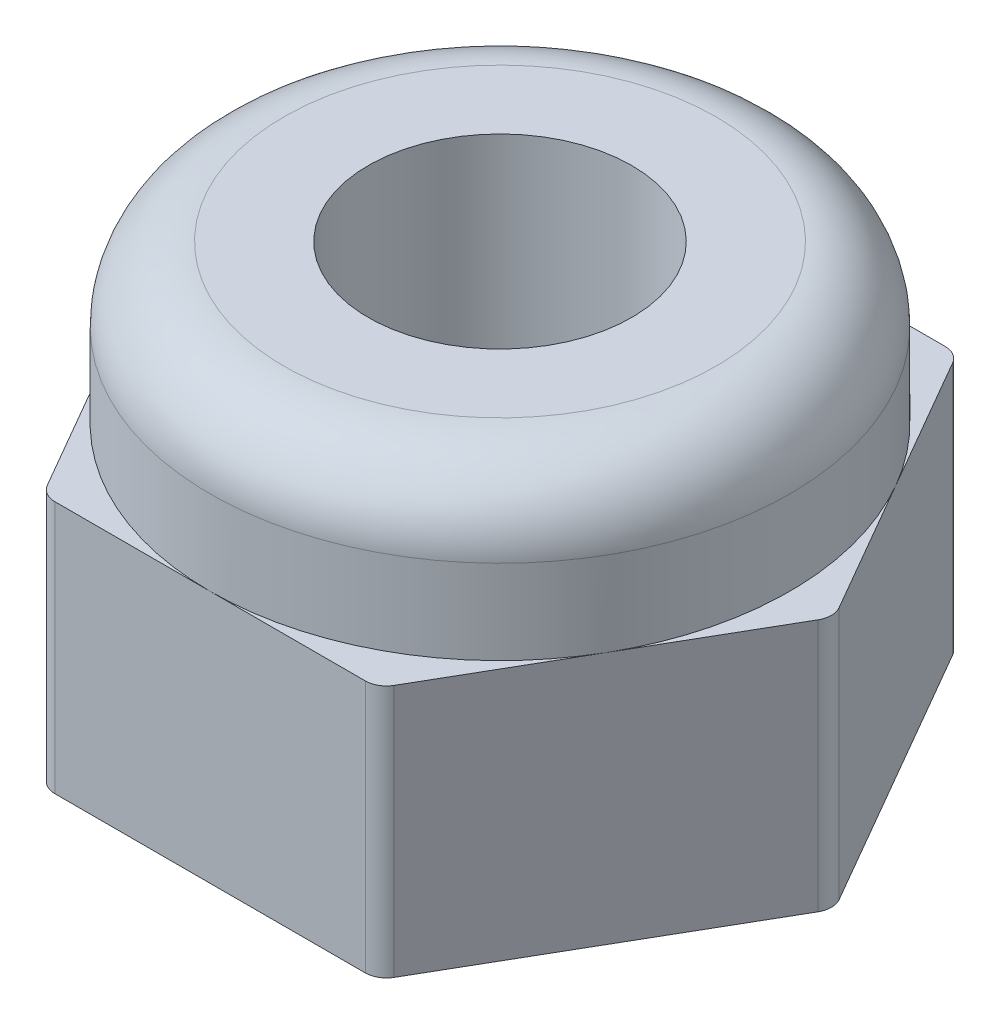
ISO-10303-21;
HEADER;
FILE_DESCRIPTION(('STEP AP214'),'2;1');
FILE_NAME('part.step','',(''),(''),'','','');
FILE_SCHEMA(('AUTOMOTIVE_DESIGN { 1 0 10303 214 1 1 1 1 }'));
ENDSEC;
DATA;
#1=APPLICATION_CONTEXT('core data for automotive mechanical design processes');
#2=APPLICATION_PROTOCOL_DEFINITION('international standard','automotive_design',2000,#1);
#3=PRODUCT_CONTEXT('',#1,'mechanical');
#4=PRODUCT('Part','Part','',(#3));
#5=PRODUCT_RELATED_PRODUCT_CATEGORY('part','',(#4));
#6=PRODUCT_DEFINITION_FORMATION('','',#4);
#7=PRODUCT_DEFINITION_CONTEXT('part definition',#1,'design');
#8=PRODUCT_DEFINITION('design','',#6,#7);
#9=PRODUCT_DEFINITION_SHAPE('','',#8);
#10=(LENGTH_UNIT() NAMED_UNIT(*) SI_UNIT(.MILLI.,.METRE.));
#11=(NAMED_UNIT(*) PLANE_ANGLE_UNIT() SI_UNIT($,.RADIAN.));
#12=(NAMED_UNIT(*) SI_UNIT($,.STERADIAN.) SOLID_ANGLE_UNIT());
#13=UNCERTAINTY_MEASURE_WITH_UNIT(LENGTH_MEASURE(1.E-05),#10,'distance_accuracy_value','');
#14=(GEOMETRIC_REPRESENTATION_CONTEXT(3) GLOBAL_UNCERTAINTY_ASSIGNED_CONTEXT((#13)) GLOBAL_UNIT_ASSIGNED_CONTEXT((#10,
#11,#12)) REPRESENTATION_CONTEXT('',''));
#15=CARTESIAN_POINT('',(0.,0.,0.));
#16=DIRECTION('',(0.,0.,1.));
#17=DIRECTION('',(1.,0.,0.));
#18=AXIS2_PLACEMENT_3D('',#15,#16,#17);
#19=CARTESIAN_POINT('',(0.,2.4,0.));
#20=DIRECTION('',(0.,1.,0.));
#21=DIRECTION('',(0.,0.,1.));
#22=AXIS2_PLACEMENT_3D('',#19,#20,#21);
#23=PLANE('',#22);
#24=DIRECTION('',(1.,0.,0.));
#25=VECTOR('',#24,1.);
#26=CARTESIAN_POINT('',(-1.58771324027147,2.4,2.75));
#27=LINE('',#26,#25);
#28=CARTESIAN_POINT('',(0.,2.4,2.75));
#29=VERTEX_POINT('',#28);
#30=CARTESIAN_POINT('',(1.47224318643355,2.4,2.75));
#31=VERTEX_POINT('',#30);
#32=EDGE_CURVE('E167',#29,#31,#27,.T.);
#33=ORIENTED_EDGE('',*,*,#32,.T.);
#34=CARTESIAN_POINT('',(1.47224318643355,2.4,2.55));
#35=DIRECTION('',(0.,1.,0.));
#36=DIRECTION('',(0.,0.,1.));
#37=AXIS2_PLACEMENT_3D('',#34,#35,#36);
#38=CIRCLE('',#37,0.2);
#39=CARTESIAN_POINT('',(1.64544826719043,2.4,2.65));
#40=VERTEX_POINT('',#39);
#41=EDGE_CURVE('E11',#31,#40,#38,.T.);
#42=ORIENTED_EDGE('',*,*,#41,.T.);
#43=DIRECTION('',(0.499999999999999,0.,-0.866025403784439));
#44=VECTOR('',#43,1.);
#45=CARTESIAN_POINT('',(1.58771324027147,2.4,2.75));
#46=LINE('',#45,#44);
#47=CARTESIAN_POINT('',(2.38156986040721,2.4,1.375));
#48=VERTEX_POINT('',#47);
#49=EDGE_CURVE('E178',#40,#48,#46,.T.);
#50=ORIENTED_EDGE('',*,*,#49,.T.);
#51=CARTESIAN_POINT('',(0.,2.4,0.));
#52=DIRECTION('',(0.,1.,0.));
#53=DIRECTION('',(0.,0.,1.));
#54=AXIS2_PLACEMENT_3D('',#51,#52,#53);
#55=CIRCLE('',#54,2.75);
#56=EDGE_CURVE('E177',#29,#48,#55,.T.);
#57=ORIENTED_EDGE('',*,*,#56,.F.);
#58=EDGE_LOOP('',(#33,#42,#50,#57));
#59=FACE_BOUND('',#58,.T.);
#60=ADVANCED_FACE('F44',(#59),#23,.T.);
#61=CARTESIAN_POINT('',(3.11769145362398,2.4,0.099999999999999));
#62=VERTEX_POINT('',#61);
#63=EDGE_CURVE('E204',#48,#62,#46,.T.);
#64=ORIENTED_EDGE('',*,*,#63,.T.);
#65=CARTESIAN_POINT('',(2.94448637286709,2.4,0.));
#66=DIRECTION('',(0.,1.,0.));
#67=DIRECTION('',(0.,0.,1.));
#68=AXIS2_PLACEMENT_3D('',#65,#66,#67);
#69=CIRCLE('',#68,0.2);
#70=CARTESIAN_POINT('',(3.11769145362398,2.4,-0.100000000000001));
#71=VERTEX_POINT('',#70);
#72=EDGE_CURVE('E53',#62,#71,#69,.T.);
#73=ORIENTED_EDGE('',*,*,#72,.T.);
#74=DIRECTION('',(-0.5,0.,-0.866025403784439));
#75=VECTOR('',#74,1.);
#76=CARTESIAN_POINT('',(3.17542648054294,2.4,0.));
#77=LINE('',#76,#75);
#78=CARTESIAN_POINT('',(2.38156986040721,2.4,-1.375));
#79=VERTEX_POINT('',#78);
#80=EDGE_CURVE('E205',#71,#79,#77,.T.);
#81=ORIENTED_EDGE('',*,*,#80,.T.);
#82=EDGE_CURVE('E184',#48,#79,#55,.T.);
#83=ORIENTED_EDGE('',*,*,#82,.F.);
#84=EDGE_LOOP('',(#64,#73,#81,#83));
#85=FACE_BOUND('',#84,.T.);
#86=ADVANCED_FACE('F318',(#85),#23,.T.);
#87=CARTESIAN_POINT('',(1.64544826719043,2.4,-2.65));
#88=VERTEX_POINT('',#87);
#89=EDGE_CURVE('E203',#79,#88,#77,.T.);
#90=ORIENTED_EDGE('',*,*,#89,.T.);
#91=CARTESIAN_POINT('',(1.47224318643354,2.4,-2.55));
#92=DIRECTION('',(0.,1.,0.));
#93=DIRECTION('',(0.,0.,1.));
#94=AXIS2_PLACEMENT_3D('',#91,#92,#93);
#95=CIRCLE('',#94,0.2);
#96=CARTESIAN_POINT('',(1.47224318643354,2.4,-2.75));
#97=VERTEX_POINT('',#96);
#98=EDGE_CURVE('E306',#88,#97,#95,.T.);
#99=ORIENTED_EDGE('',*,*,#98,.T.);
#100=DIRECTION('',(-1.,0.,0.));
#101=VECTOR('',#100,1.);
#102=CARTESIAN_POINT('',(1.58771324027147,2.4,-2.75));
#103=LINE('',#102,#101);
#104=CARTESIAN_POINT('',(0.,2.4,-2.75));
#105=VERTEX_POINT('',#104);
#106=EDGE_CURVE('E209',#97,#105,#103,.T.);
#107=ORIENTED_EDGE('',*,*,#106,.T.);
#108=EDGE_CURVE('E372',#79,#105,#55,.T.);
#109=ORIENTED_EDGE('',*,*,#108,.F.);
#110=EDGE_LOOP('',(#90,#99,#107,#109));
#111=FACE_BOUND('',#110,.T.);
#112=ADVANCED_FACE('F370',(#111),#23,.T.);
#113=CARTESIAN_POINT('',(-1.47224318643355,2.4,-2.75));
#114=VERTEX_POINT('',#113);
#115=EDGE_CURVE('E208',#105,#114,#103,.T.);
#116=ORIENTED_EDGE('',*,*,#115,.T.);
#117=CARTESIAN_POINT('',(-1.47224318643355,2.4,-2.55));
#118=DIRECTION('',(0.,1.,0.));
#119=DIRECTION('',(0.,0.,1.));
#120=AXIS2_PLACEMENT_3D('',#117,#118,#119);
#121=CIRCLE('',#120,0.2);
#122=CARTESIAN_POINT('',(-1.64544826719043,2.4,-2.65));
#123=VERTEX_POINT('',#122);
#124=EDGE_CURVE('E296',#114,#123,#121,.T.);
#125=ORIENTED_EDGE('',*,*,#124,.T.);
#126=DIRECTION('',(-0.5,0.,0.866025403784439));
#127=VECTOR('',#126,1.);
#128=CARTESIAN_POINT('',(-1.58771324027147,2.4,-2.75));
#129=LINE('',#128,#127);
#130=CARTESIAN_POINT('',(-2.38156986040721,2.4,-1.375));
#131=VERTEX_POINT('',#130);
#132=EDGE_CURVE('E213',#123,#131,#129,.T.);
#133=ORIENTED_EDGE('',*,*,#132,.T.);
#134=EDGE_CURVE('E195',#105,#131,#55,.T.);
#135=ORIENTED_EDGE('',*,*,#134,.F.);
#136=EDGE_LOOP('',(#116,#125,#133,#135));
#137=FACE_BOUND('',#136,.T.);
#138=ADVANCED_FACE('F381',(#137),#23,.T.);
#139=CARTESIAN_POINT('',(-3.11769145362398,2.4,-0.099999999999999));
#140=VERTEX_POINT('',#139);
#141=EDGE_CURVE('E212',#131,#140,#129,.T.);
#142=ORIENTED_EDGE('',*,*,#141,.T.);
#143=CARTESIAN_POINT('',(-2.94448637286709,2.4,0.));
#144=DIRECTION('',(0.,1.,0.));
#145=DIRECTION('',(0.,0.,1.));
#146=AXIS2_PLACEMENT_3D('',#143,#144,#145);
#147=CIRCLE('',#146,0.2);
#148=CARTESIAN_POINT('',(-3.11769145362398,2.4,0.100000000000001));
#149=VERTEX_POINT('',#148);
#150=EDGE_CURVE('E286',#140,#149,#147,.T.);
#151=ORIENTED_EDGE('',*,*,#150,.T.);
#152=DIRECTION('',(0.5,0.,0.866025403784439));
#153=VECTOR('',#152,1.);
#154=CARTESIAN_POINT('',(-3.17542648054294,2.4,0.));
#155=LINE('',#154,#153);
#156=CARTESIAN_POINT('',(-2.38156986040721,2.4,1.375));
#157=VERTEX_POINT('',#156);
#158=EDGE_CURVE('E175',#149,#157,#155,.T.);
#159=ORIENTED_EDGE('',*,*,#158,.T.);
#160=EDGE_CURVE('E190',#131,#157,#55,.T.);
#161=ORIENTED_EDGE('',*,*,#160,.F.);
#162=EDGE_LOOP('',(#142,#151,#159,#161));
#163=FACE_BOUND('',#162,.T.);
#164=ADVANCED_FACE('F385',(#163),#23,.T.);
#165=CARTESIAN_POINT('',(1.58771324027147,2.4,2.75));
#166=DIRECTION('',(-0.866025403784439,0.,-0.499999999999999));
#167=DIRECTION('',(-0.5,0.,0.866025403784439));
#168=AXIS2_PLACEMENT_3D('',#165,#166,#167);
#169=PLANE('',#168);
#170=DIRECTION('',(0.499999999999999,0.,-0.866025403784439));
#171=VECTOR('',#170,1.);
#172=CARTESIAN_POINT('',(1.58771324027147,0.,2.75));
#173=LINE('',#172,#171);
#174=CARTESIAN_POINT('',(1.64544826719043,0.,2.65));
#175=VERTEX_POINT('',#174);
#176=CARTESIAN_POINT('',(3.11769145362398,0.,0.099999999999999));
#177=VERTEX_POINT('',#176);
#178=EDGE_CURVE('E183',#175,#177,#173,.T.);
#179=ORIENTED_EDGE('',*,*,#178,.T.);
#180=DIRECTION('',(0.,-1.,0.));
#181=VECTOR('',#180,1.);
#182=CARTESIAN_POINT('',(3.11769145362398,2.4,0.0999999999999985));
#183=LINE('',#182,#181);
#184=EDGE_CURVE('E66',#177,#62,#183,.F.);
#185=ORIENTED_EDGE('',*,*,#184,.T.);
#186=ORIENTED_EDGE('',*,*,#63,.F.);
#187=ORIENTED_EDGE('',*,*,#49,.F.);
#188=DIRECTION('',(0.,-1.,0.));
#189=VECTOR('',#188,1.);
#190=CARTESIAN_POINT('',(1.64544826719043,2.4,2.65));
#191=LINE('',#190,#189);
#192=EDGE_CURVE('E309',#40,#175,#191,.T.);
#193=ORIENTED_EDGE('',*,*,#192,.T.);
#194=EDGE_LOOP('',(#179,#185,#186,#187,#193));
#195=FACE_BOUND('',#194,.T.);
#196=ADVANCED_FACE('F332',(#195),#169,.F.);
#197=CARTESIAN_POINT('',(3.17542648054294,2.4,0.));
#198=DIRECTION('',(-0.866025403784439,0.,0.5));
#199=DIRECTION('',(0.5,0.,0.866025403784439));
#200=AXIS2_PLACEMENT_3D('',#197,#198,#199);
#201=PLANE('',#200);
#202=DIRECTION('',(-0.5,0.,-0.866025403784439));
#203=VECTOR('',#202,1.);
#204=CARTESIAN_POINT('',(3.17542648054294,0.,0.));
#205=LINE('',#204,#203);
#206=CARTESIAN_POINT('',(3.11769145362398,0.,-0.100000000000001));
#207=VERTEX_POINT('',#206);
#208=CARTESIAN_POINT('',(1.64544826719043,0.,-2.65));
#209=VERTEX_POINT('',#208);
#210=EDGE_CURVE('E221',#207,#209,#205,.T.);
#211=ORIENTED_EDGE('',*,*,#210,.T.);
#212=DIRECTION('',(0.,-1.,0.));
#213=VECTOR('',#212,1.);
#214=CARTESIAN_POINT('',(1.64544826719043,2.4,-2.65));
#215=LINE('',#214,#213);
#216=EDGE_CURVE('E303',#209,#88,#215,.F.);
#217=ORIENTED_EDGE('',*,*,#216,.T.);
#218=ORIENTED_EDGE('',*,*,#89,.F.);
#219=ORIENTED_EDGE('',*,*,#80,.F.);
#220=DIRECTION('',(0.,-1.,0.));
#221=VECTOR('',#220,1.);
#222=CARTESIAN_POINT('',(3.11769145362398,2.4,-0.100000000000001));
#223=LINE('',#222,#221);
#224=EDGE_CURVE('E299',#71,#207,#223,.T.);
#225=ORIENTED_EDGE('',*,*,#224,.T.);
#226=EDGE_LOOP('',(#211,#217,#218,#219,#225));
#227=FACE_BOUND('',#226,.T.);
#228=ADVANCED_FACE('F324',(#227),#201,.F.);
#229=CARTESIAN_POINT('',(1.58771324027147,2.4,-2.75));
#230=DIRECTION('',(0.,0.,1.));
#231=DIRECTION('',(1.,0.,0.));
#232=AXIS2_PLACEMENT_3D('',#229,#230,#231);
#233=PLANE('',#232);
#234=DIRECTION('',(-1.,0.,0.));
#235=VECTOR('',#234,1.);
#236=CARTESIAN_POINT('',(1.58771324027147,0.,-2.75));
#237=LINE('',#236,#235);
#238=CARTESIAN_POINT('',(1.47224318643354,0.,-2.75));
#239=VERTEX_POINT('',#238);
#240=CARTESIAN_POINT('',(-1.47224318643355,0.,-2.75));
#241=VERTEX_POINT('',#240);
#242=EDGE_CURVE('E225',#239,#241,#237,.T.);
#243=ORIENTED_EDGE('',*,*,#242,.T.);
#244=DIRECTION('',(0.,-1.,0.));
#245=VECTOR('',#244,1.);
#246=CARTESIAN_POINT('',(-1.47224318643355,2.4,-2.75));
#247=LINE('',#246,#245);
#248=EDGE_CURVE('E293',#241,#114,#247,.F.);
#249=ORIENTED_EDGE('',*,*,#248,.T.);
#250=ORIENTED_EDGE('',*,*,#115,.F.);
#251=ORIENTED_EDGE('',*,*,#106,.F.);
#252=DIRECTION('',(0.,-1.,0.));
#253=VECTOR('',#252,1.);
#254=CARTESIAN_POINT('',(1.47224318643354,2.4,-2.75));
#255=LINE('',#254,#253);
#256=EDGE_CURVE('E289',#97,#239,#255,.T.);
#257=ORIENTED_EDGE('',*,*,#256,.T.);
#258=EDGE_LOOP('',(#243,#249,#250,#251,#257));
#259=FACE_BOUND('',#258,.T.);
#260=ADVANCED_FACE('F360',(#259),#233,.F.);
#261=CARTESIAN_POINT('',(-1.58771324027147,2.4,-2.75));
#262=DIRECTION('',(0.866025403784439,0.,0.5));
#263=DIRECTION('',(0.5,0.,-0.866025403784439));
#264=AXIS2_PLACEMENT_3D('',#261,#262,#263);
#265=PLANE('',#264);
#266=DIRECTION('',(-0.5,0.,0.866025403784439));
#267=VECTOR('',#266,1.);
#268=CARTESIAN_POINT('',(-1.58771324027147,0.,-2.75));
#269=LINE('',#268,#267);
#270=CARTESIAN_POINT('',(-1.64544826719043,0.,-2.65));
#271=VERTEX_POINT('',#270);
#272=CARTESIAN_POINT('',(-3.11769145362398,0.,-0.099999999999999));
#273=VERTEX_POINT('',#272);
#274=EDGE_CURVE('E229',#271,#273,#269,.T.);
#275=ORIENTED_EDGE('',*,*,#274,.T.);
#276=DIRECTION('',(0.,-1.,0.));
#277=VECTOR('',#276,1.);
#278=CARTESIAN_POINT('',(-3.11769145362398,2.4,-0.0999999999999985));
#279=LINE('',#278,#277);
#280=EDGE_CURVE('E283',#273,#140,#279,.F.);
#281=ORIENTED_EDGE('',*,*,#280,.T.);
#282=ORIENTED_EDGE('',*,*,#141,.F.);
#283=ORIENTED_EDGE('',*,*,#132,.F.);
#284=DIRECTION('',(0.,-1.,0.));
#285=VECTOR('',#284,1.);
#286=CARTESIAN_POINT('',(-1.64544826719043,2.4,-2.65));
#287=LINE('',#286,#285);
#288=EDGE_CURVE('E279',#123,#271,#287,.T.);
#289=ORIENTED_EDGE('',*,*,#288,.T.);
#290=EDGE_LOOP('',(#275,#281,#282,#283,#289));
#291=FACE_BOUND('',#290,.T.);
#292=ADVANCED_FACE('F349',(#291),#265,.F.);
#293=CARTESIAN_POINT('',(-3.17542648054294,2.4,0.));
#294=DIRECTION('',(0.866025403784439,0.,-0.5));
#295=DIRECTION('',(-0.5,0.,-0.866025403784439));
#296=AXIS2_PLACEMENT_3D('',#293,#294,#295);
#297=PLANE('',#296);
#298=DIRECTION('',(0.5,0.,0.866025403784439));
#299=VECTOR('',#298,1.);
#300=CARTESIAN_POINT('',(-3.17542648054294,0.,0.));
#301=LINE('',#300,#299);
#302=CARTESIAN_POINT('',(-3.11769145362398,0.,0.100000000000001));
#303=VERTEX_POINT('',#302);
#304=CARTESIAN_POINT('',(-1.64544826719043,0.,2.65));
#305=VERTEX_POINT('',#304);
#306=EDGE_CURVE('E233',#303,#305,#301,.T.);
#307=ORIENTED_EDGE('',*,*,#306,.T.);
#308=DIRECTION('',(0.,-1.,0.));
#309=VECTOR('',#308,1.);
#310=CARTESIAN_POINT('',(-1.64544826719043,2.4,2.65));
#311=LINE('',#310,#309);
#312=CARTESIAN_POINT('',(-1.64544826719043,2.4,2.65));
#313=VERTEX_POINT('',#312);
#314=EDGE_CURVE('E274',#305,#313,#311,.F.);
#315=ORIENTED_EDGE('',*,*,#314,.T.);
#316=EDGE_CURVE('E216',#157,#313,#155,.T.);
#317=ORIENTED_EDGE('',*,*,#316,.F.);
#318=ORIENTED_EDGE('',*,*,#158,.F.);
#319=DIRECTION('',(0.,-1.,0.));
#320=VECTOR('',#319,1.);
#321=CARTESIAN_POINT('',(-3.11769145362398,2.4,0.100000000000001));
#322=LINE('',#321,#320);
#323=EDGE_CURVE('E270',#149,#303,#322,.T.);
#324=ORIENTED_EDGE('',*,*,#323,.T.);
#325=EDGE_LOOP('',(#307,#315,#317,#318,#324));
#326=FACE_BOUND('',#325,.T.);
#327=ADVANCED_FACE('F340',(#326),#297,.F.);
#328=CARTESIAN_POINT('',(-1.58771324027147,2.4,2.75));
#329=DIRECTION('',(0.,0.,-1.));
#330=DIRECTION('',(-1.,0.,0.));
#331=AXIS2_PLACEMENT_3D('',#328,#329,#330);
#332=PLANE('',#331);
#333=CARTESIAN_POINT('',(-1.47224318643355,2.4,2.75));
#334=VERTEX_POINT('',#333);
#335=EDGE_CURVE('E153',#334,#29,#27,.T.);
#336=ORIENTED_EDGE('',*,*,#335,.F.);
#337=DIRECTION('',(0.,-1.,0.));
#338=VECTOR('',#337,1.);
#339=CARTESIAN_POINT('',(-1.47224318643355,2.4,2.75));
#340=LINE('',#339,#338);
#341=CARTESIAN_POINT('',(-1.47224318643355,0.,2.75));
#342=VERTEX_POINT('',#341);
#343=EDGE_CURVE('E249',#334,#342,#340,.T.);
#344=ORIENTED_EDGE('',*,*,#343,.T.);
#345=DIRECTION('',(1.,0.,0.));
#346=VECTOR('',#345,1.);
#347=CARTESIAN_POINT('',(-1.58771324027147,0.,2.75));
#348=LINE('',#347,#346);
#349=CARTESIAN_POINT('',(1.47224318643355,0.,2.75));
#350=VERTEX_POINT('',#349);
#351=EDGE_CURVE('E237',#342,#350,#348,.T.);
#352=ORIENTED_EDGE('',*,*,#351,.T.);
#353=DIRECTION('',(0.,-1.,0.));
#354=VECTOR('',#353,1.);
#355=CARTESIAN_POINT('',(1.47224318643355,2.4,2.75));
#356=LINE('',#355,#354);
#357=EDGE_CURVE('E173',#350,#31,#356,.F.);
#358=ORIENTED_EDGE('',*,*,#357,.T.);
#359=ORIENTED_EDGE('',*,*,#32,.F.);
#360=EDGE_LOOP('',(#336,#344,#352,#358,#359));
#361=FACE_BOUND('',#360,.T.);
#362=ADVANCED_FACE('F170',(#361),#332,.F.);
#363=ORIENTED_EDGE('',*,*,#316,.T.);
#364=CARTESIAN_POINT('',(-1.47224318643355,2.4,2.55));
#365=DIRECTION('',(0.,1.,0.));
#366=DIRECTION('',(0.,0.,1.));
#367=AXIS2_PLACEMENT_3D('',#364,#365,#366);
#368=CIRCLE('',#367,0.2);
#369=EDGE_CURVE('E161',#313,#334,#368,.T.);
#370=ORIENTED_EDGE('',*,*,#369,.T.);
#371=ORIENTED_EDGE('',*,*,#335,.T.);
#372=EDGE_CURVE('E158',#157,#29,#55,.T.);
#373=ORIENTED_EDGE('',*,*,#372,.F.);
#374=EDGE_LOOP('',(#363,#370,#371,#373));
#375=FACE_BOUND('',#374,.T.);
#376=ADVANCED_FACE('F156',(#375),#23,.T.);
#377=CARTESIAN_POINT('',(0.,0.,0.));
#378=DIRECTION('',(0.,1.,0.));
#379=DIRECTION('',(0.,0.,1.));
#380=AXIS2_PLACEMENT_3D('',#377,#378,#379);
#381=PLANE('',#380);
#382=CARTESIAN_POINT('',(0.,0.,0.));
#383=DIRECTION('',(0.,-1.,0.));
#384=DIRECTION('',(0.,0.,-1.));
#385=AXIS2_PLACEMENT_3D('',#382,#383,#384);
#386=CIRCLE('',#385,1.25);
#387=CARTESIAN_POINT('',(0.,0.,-1.25));
#388=VERTEX_POINT('',#387);
#389=EDGE_CURVE('E197',#388,#388,#386,.T.);
#390=ORIENTED_EDGE('',*,*,#389,.F.);
#391=EDGE_LOOP('',(#390));
#392=FACE_BOUND('',#391,.T.);
#393=ORIENTED_EDGE('',*,*,#351,.F.);
#394=CARTESIAN_POINT('',(-1.47224318643355,0.,2.55));
#395=DIRECTION('',(0.,1.,0.));
#396=DIRECTION('',(0.,0.,1.));
#397=AXIS2_PLACEMENT_3D('',#394,#395,#396);
#398=CIRCLE('',#397,0.2);
#399=EDGE_CURVE('E267',#342,#305,#398,.F.);
#400=ORIENTED_EDGE('',*,*,#399,.T.);
#401=ORIENTED_EDGE('',*,*,#306,.F.);
#402=CARTESIAN_POINT('',(-2.94448637286709,0.,0.));
#403=DIRECTION('',(0.,1.,0.));
#404=DIRECTION('',(0.,0.,1.));
#405=AXIS2_PLACEMENT_3D('',#402,#403,#404);
#406=CIRCLE('',#405,0.2);
#407=EDGE_CURVE('E264',#303,#273,#406,.F.);
#408=ORIENTED_EDGE('',*,*,#407,.T.);
#409=ORIENTED_EDGE('',*,*,#274,.F.);
#410=CARTESIAN_POINT('',(-1.47224318643355,0.,-2.55));
#411=DIRECTION('',(0.,1.,0.));
#412=DIRECTION('',(0.,0.,1.));
#413=AXIS2_PLACEMENT_3D('',#410,#411,#412);
#414=CIRCLE('',#413,0.2);
#415=EDGE_CURVE('E261',#271,#241,#414,.F.);
#416=ORIENTED_EDGE('',*,*,#415,.T.);
#417=ORIENTED_EDGE('',*,*,#242,.F.);
#418=CARTESIAN_POINT('',(1.47224318643354,0.,-2.55));
#419=DIRECTION('',(0.,1.,0.));
#420=DIRECTION('',(0.,0.,1.));
#421=AXIS2_PLACEMENT_3D('',#418,#419,#420);
#422=CIRCLE('',#421,0.2);
#423=EDGE_CURVE('E258',#239,#209,#422,.F.);
#424=ORIENTED_EDGE('',*,*,#423,.T.);
#425=ORIENTED_EDGE('',*,*,#210,.F.);
#426=CARTESIAN_POINT('',(2.94448637286709,0.,0.));
#427=DIRECTION('',(0.,1.,0.));
#428=DIRECTION('',(0.,0.,1.));
#429=AXIS2_PLACEMENT_3D('',#426,#427,#428);
#430=CIRCLE('',#429,0.2);
#431=EDGE_CURVE('E255',#207,#177,#430,.F.);
#432=ORIENTED_EDGE('',*,*,#431,.T.);
#433=ORIENTED_EDGE('',*,*,#178,.F.);
#434=CARTESIAN_POINT('',(1.47224318643355,0.,2.55));
#435=DIRECTION('',(0.,1.,0.));
#436=DIRECTION('',(0.,0.,1.));
#437=AXIS2_PLACEMENT_3D('',#434,#435,#436);
#438=CIRCLE('',#437,0.2);
#439=EDGE_CURVE('E252',#175,#350,#438,.F.);
#440=ORIENTED_EDGE('',*,*,#439,.T.);
#441=EDGE_LOOP('',(#393,#400,#401,#408,#409,#416,#417,#424,#425,#432,#433,#440));
#442=FACE_BOUND('',#441,.T.);
#443=ADVANCED_FACE('F331',(#392,#442),#381,.F.);
#444=CARTESIAN_POINT('',(0.,3.9,0.));
#445=DIRECTION('',(0.,-1.,0.));
#446=DIRECTION('',(0.,0.,-1.));
#447=AXIS2_PLACEMENT_3D('',#444,#445,#446);
#448=CYLINDRICAL_SURFACE('',#447,2.75);
#449=CARTESIAN_POINT('',(0.,3.2,0.));
#450=DIRECTION('',(0.,-1.,0.));
#451=DIRECTION('',(0.,0.,-1.));
#452=AXIS2_PLACEMENT_3D('',#449,#450,#451);
#453=CIRCLE('',#452,2.75);
#454=CARTESIAN_POINT('',(0.,3.2,-2.75));
#455=VERTEX_POINT('',#454);
#456=EDGE_CURVE('E166',#455,#455,#453,.T.);
#457=ORIENTED_EDGE('',*,*,#456,.T.);
#458=EDGE_LOOP('',(#457));
#459=FACE_BOUND('',#458,.T.);
#460=ORIENTED_EDGE('',*,*,#372,.T.);
#461=ORIENTED_EDGE('',*,*,#56,.T.);
#462=ORIENTED_EDGE('',*,*,#82,.T.);
#463=ORIENTED_EDGE('',*,*,#108,.T.);
#464=ORIENTED_EDGE('',*,*,#134,.T.);
#465=ORIENTED_EDGE('',*,*,#160,.T.);
#466=EDGE_LOOP('',(#460,#461,#462,#463,#464,#465));
#467=FACE_BOUND('',#466,.T.);
#468=ADVANCED_FACE('F187',(#459,#467),#448,.T.);
#469=CARTESIAN_POINT('',(0.,3.9,0.));
#470=DIRECTION('',(0.,-1.,0.));
#471=DIRECTION('',(0.,0.,-1.));
#472=AXIS2_PLACEMENT_3D('',#469,#470,#471);
#473=PLANE('',#472);
#474=CARTESIAN_POINT('',(0.,3.9,0.));
#475=DIRECTION('',(0.,-1.,0.));
#476=DIRECTION('',(0.,0.,-1.));
#477=AXIS2_PLACEMENT_3D('',#474,#475,#476);
#478=CIRCLE('',#477,1.25);
#479=CARTESIAN_POINT('',(0.,3.9,-1.25));
#480=VERTEX_POINT('',#479);
#481=EDGE_CURVE('E192',#480,#480,#478,.T.);
#482=ORIENTED_EDGE('',*,*,#481,.T.);
#483=EDGE_LOOP('',(#482));
#484=FACE_BOUND('',#483,.T.);
#485=CARTESIAN_POINT('',(0.,3.9,0.));
#486=DIRECTION('',(0.,-1.,0.));
#487=DIRECTION('',(0.,0.,-1.));
#488=AXIS2_PLACEMENT_3D('',#485,#486,#487);
#489=CIRCLE('',#488,2.05);
#490=CARTESIAN_POINT('',(0.,3.9,-2.05));
#491=VERTEX_POINT('',#490);
#492=EDGE_CURVE('E243',#491,#491,#489,.F.);
#493=ORIENTED_EDGE('',*,*,#492,.T.);
#494=EDGE_LOOP('',(#493));
#495=FACE_BOUND('',#494,.T.);
#496=ADVANCED_FACE('F532',(#484,#495),#473,.F.);
#497=CARTESIAN_POINT('',(0.,3.2,0.));
#498=DIRECTION('',(0.,-1.,0.));
#499=DIRECTION('',(0.,0.,-1.));
#500=AXIS2_PLACEMENT_3D('',#497,#498,#499);
#501=TOROIDAL_SURFACE('',#500,2.05,0.7);
#502=ORIENTED_EDGE('',*,*,#492,.F.);
#503=EDGE_LOOP('',(#502));
#504=FACE_BOUND('',#503,.T.);
#505=ORIENTED_EDGE('',*,*,#456,.F.);
#506=EDGE_LOOP('',(#505));
#507=FACE_BOUND('',#506,.T.);
#508=ADVANCED_FACE('F476',(#504,#507),#501,.T.);
#509=CARTESIAN_POINT('',(-1.47224318643355,2.4,2.55));
#510=DIRECTION('',(0.,-1.,0.));
#511=DIRECTION('',(0.,0.,-1.));
#512=AXIS2_PLACEMENT_3D('',#509,#510,#511);
#513=CYLINDRICAL_SURFACE('',#512,0.2);
#514=ORIENTED_EDGE('',*,*,#369,.F.);
#515=ORIENTED_EDGE('',*,*,#314,.F.);
#516=ORIENTED_EDGE('',*,*,#399,.F.);
#517=ORIENTED_EDGE('',*,*,#343,.F.);
#518=EDGE_LOOP('',(#514,#515,#516,#517));
#519=FACE_BOUND('',#518,.T.);
#520=ADVANCED_FACE('F336',(#519),#513,.T.);
#521=CARTESIAN_POINT('',(-2.94448637286709,2.4,0.));
#522=DIRECTION('',(0.,-1.,0.));
#523=DIRECTION('',(0.,0.,-1.));
#524=AXIS2_PLACEMENT_3D('',#521,#522,#523);
#525=CYLINDRICAL_SURFACE('',#524,0.2);
#526=ORIENTED_EDGE('',*,*,#150,.F.);
#527=ORIENTED_EDGE('',*,*,#280,.F.);
#528=ORIENTED_EDGE('',*,*,#407,.F.);
#529=ORIENTED_EDGE('',*,*,#323,.F.);
#530=EDGE_LOOP('',(#526,#527,#528,#529));
#531=FACE_BOUND('',#530,.T.);
#532=ADVANCED_FACE('F345',(#531),#525,.T.);
#533=CARTESIAN_POINT('',(-1.47224318643355,2.4,-2.55));
#534=DIRECTION('',(0.,-1.,0.));
#535=DIRECTION('',(0.,0.,-1.));
#536=AXIS2_PLACEMENT_3D('',#533,#534,#535);
#537=CYLINDRICAL_SURFACE('',#536,0.2);
#538=ORIENTED_EDGE('',*,*,#124,.F.);
#539=ORIENTED_EDGE('',*,*,#248,.F.);
#540=ORIENTED_EDGE('',*,*,#415,.F.);
#541=ORIENTED_EDGE('',*,*,#288,.F.);
#542=EDGE_LOOP('',(#538,#539,#540,#541));
#543=FACE_BOUND('',#542,.T.);
#544=ADVANCED_FACE('F356',(#543),#537,.T.);
#545=CARTESIAN_POINT('',(1.47224318643354,2.4,-2.55));
#546=DIRECTION('',(0.,-1.,0.));
#547=DIRECTION('',(0.,0.,-1.));
#548=AXIS2_PLACEMENT_3D('',#545,#546,#547);
#549=CYLINDRICAL_SURFACE('',#548,0.2);
#550=ORIENTED_EDGE('',*,*,#98,.F.);
#551=ORIENTED_EDGE('',*,*,#216,.F.);
#552=ORIENTED_EDGE('',*,*,#423,.F.);
#553=ORIENTED_EDGE('',*,*,#256,.F.);
#554=EDGE_LOOP('',(#550,#551,#552,#553));
#555=FACE_BOUND('',#554,.T.);
#556=ADVANCED_FACE('F367',(#555),#549,.T.);
#557=CARTESIAN_POINT('',(2.94448637286709,2.4,0.));
#558=DIRECTION('',(0.,-1.,0.));
#559=DIRECTION('',(0.,0.,-1.));
#560=AXIS2_PLACEMENT_3D('',#557,#558,#559);
#561=CYLINDRICAL_SURFACE('',#560,0.2);
#562=ORIENTED_EDGE('',*,*,#72,.F.);
#563=ORIENTED_EDGE('',*,*,#184,.F.);
#564=ORIENTED_EDGE('',*,*,#431,.F.);
#565=ORIENTED_EDGE('',*,*,#224,.F.);
#566=EDGE_LOOP('',(#562,#563,#564,#565));
#567=FACE_BOUND('',#566,.T.);
#568=ADVANCED_FACE('F327',(#567),#561,.T.);
#569=CARTESIAN_POINT('',(1.47224318643355,2.4,2.55));
#570=DIRECTION('',(0.,-1.,0.));
#571=DIRECTION('',(0.,0.,-1.));
#572=AXIS2_PLACEMENT_3D('',#569,#570,#571);
#573=CYLINDRICAL_SURFACE('',#572,0.2);
#574=ORIENTED_EDGE('',*,*,#41,.F.);
#575=ORIENTED_EDGE('',*,*,#357,.F.);
#576=ORIENTED_EDGE('',*,*,#439,.F.);
#577=ORIENTED_EDGE('',*,*,#192,.F.);
#578=EDGE_LOOP('',(#574,#575,#576,#577));
#579=FACE_BOUND('',#578,.T.);
#580=ADVANCED_FACE('F46',(#579),#573,.T.);
#581=CARTESIAN_POINT('',(0.,0.,0.));
#582=DIRECTION('',(0.,-1.,0.));
#583=DIRECTION('',(0.,0.,-1.));
#584=AXIS2_PLACEMENT_3D('',#581,#582,#583);
#585=CYLINDRICAL_SURFACE('',#584,1.25);
#586=ORIENTED_EDGE('',*,*,#481,.F.);
#587=EDGE_LOOP('',(#586));
#588=FACE_BOUND('',#587,.T.);
#589=ORIENTED_EDGE('',*,*,#389,.T.);
#590=EDGE_LOOP('',(#589));
#591=FACE_BOUND('',#590,.T.);
#592=ADVANCED_FACE('F518',(#588,#591),#585,.F.);
#593=CLOSED_SHELL('',(#60,#86,#112,#138,#164,#196,#228,#260,#292,#327,#362,#376,#443,#468,#496,
#508,#520,#532,#544,#556,#568,#580,#592));
#594=MANIFOLD_SOLID_BREP('B2',#593);
#595=ADVANCED_BREP_SHAPE_REPRESENTATION('',(#18,#594),#14);
#596=SHAPE_DEFINITION_REPRESENTATION(#9,#595);
ENDSEC;
END-ISO-10303-21;
